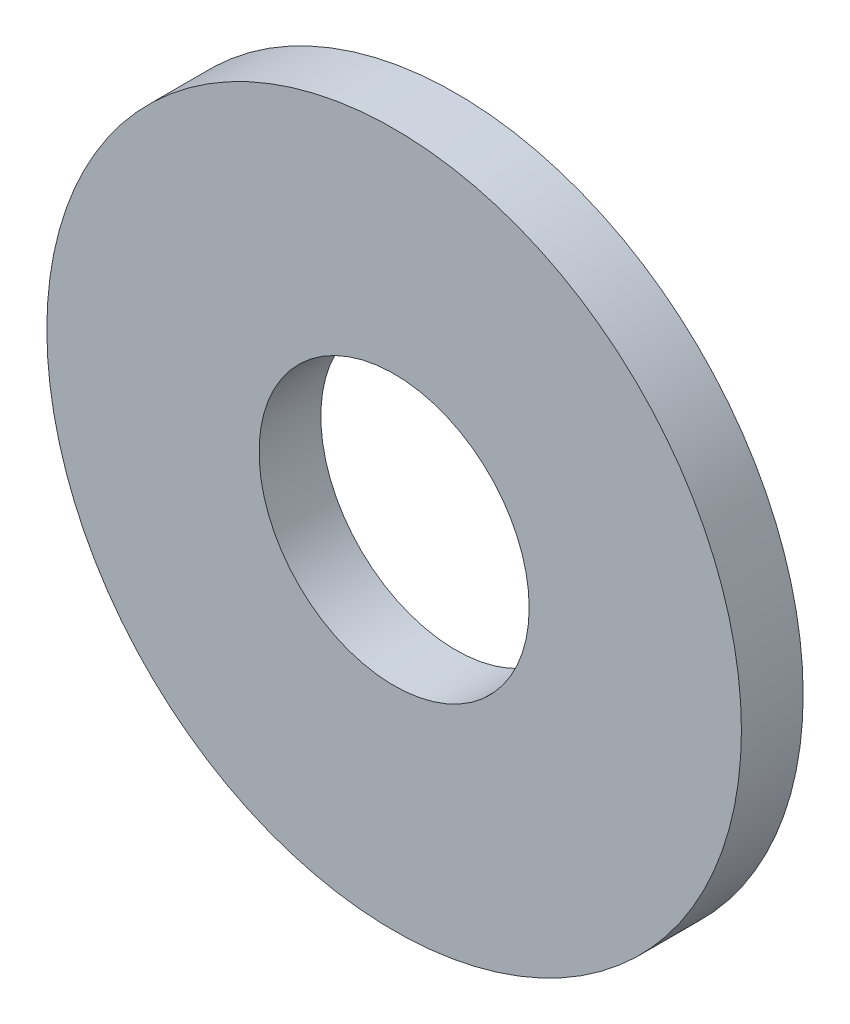
ISO-10303-21;
HEADER;
FILE_DESCRIPTION(('STEP AP214'),'2;1');
FILE_NAME('part.step','',(''),(''),'','','');
FILE_SCHEMA(('AUTOMOTIVE_DESIGN { 1 0 10303 214 1 1 1 1 }'));
ENDSEC;
DATA;
#1=APPLICATION_CONTEXT('core data for automotive mechanical design processes');
#2=APPLICATION_PROTOCOL_DEFINITION('international standard','automotive_design',2000,#1);
#3=PRODUCT_CONTEXT('',#1,'mechanical');
#4=PRODUCT('Part','Part','',(#3));
#5=PRODUCT_RELATED_PRODUCT_CATEGORY('part','',(#4));
#6=PRODUCT_DEFINITION_FORMATION('','',#4);
#7=PRODUCT_DEFINITION_CONTEXT('part definition',#1,'design');
#8=PRODUCT_DEFINITION('design','',#6,#7);
#9=PRODUCT_DEFINITION_SHAPE('','',#8);
#10=(LENGTH_UNIT() NAMED_UNIT(*) SI_UNIT(.MILLI.,.METRE.));
#11=(NAMED_UNIT(*) PLANE_ANGLE_UNIT() SI_UNIT($,.RADIAN.));
#12=(NAMED_UNIT(*) SI_UNIT($,.STERADIAN.) SOLID_ANGLE_UNIT());
#13=UNCERTAINTY_MEASURE_WITH_UNIT(LENGTH_MEASURE(1.E-05),#10,'distance_accuracy_value','');
#14=(GEOMETRIC_REPRESENTATION_CONTEXT(3) GLOBAL_UNCERTAINTY_ASSIGNED_CONTEXT((#13)) GLOBAL_UNIT_ASSIGNED_CONTEXT((#10,
#11,#12)) REPRESENTATION_CONTEXT('',''));
#15=CARTESIAN_POINT('',(0.,0.,0.));
#16=DIRECTION('',(0.,0.,1.));
#17=DIRECTION('',(1.,0.,0.));
#18=AXIS2_PLACEMENT_3D('',#15,#16,#17);
#19=CARTESIAN_POINT('',(0.,0.,1.6));
#20=DIRECTION('',(0.,0.,1.));
#21=DIRECTION('',(1.,0.,0.));
#22=AXIS2_PLACEMENT_3D('',#19,#20,#21);
#23=PLANE('',#22);
#24=CARTESIAN_POINT('',(0.,0.,1.6));
#25=DIRECTION('',(0.,0.,1.));
#26=DIRECTION('',(1.,0.,0.));
#27=AXIS2_PLACEMENT_3D('',#24,#25,#26);
#28=CIRCLE('',#27,9.);
#29=CARTESIAN_POINT('',(9.,0.,1.6));
#30=VERTEX_POINT('',#29);
#31=EDGE_CURVE('E10',#30,#30,#28,.T.);
#32=ORIENTED_EDGE('',*,*,#31,.T.);
#33=EDGE_LOOP('',(#32));
#34=FACE_BOUND('',#33,.T.);
#35=CARTESIAN_POINT('',(0.,0.,1.6));
#36=DIRECTION('',(0.,0.,1.));
#37=DIRECTION('',(1.,0.,0.));
#38=AXIS2_PLACEMENT_3D('',#35,#36,#37);
#39=CIRCLE('',#38,3.5);
#40=CARTESIAN_POINT('',(3.5,0.,1.6));
#41=VERTEX_POINT('',#40);
#42=EDGE_CURVE('E42',#41,#41,#39,.T.);
#43=ORIENTED_EDGE('',*,*,#42,.F.);
#44=EDGE_LOOP('',(#43));
#45=FACE_BOUND('',#44,.T.);
#46=ADVANCED_FACE('F31',(#34,#45),#23,.T.);
#47=CARTESIAN_POINT('',(0.,0.,0.));
#48=DIRECTION('',(0.,0.,1.));
#49=DIRECTION('',(1.,0.,0.));
#50=AXIS2_PLACEMENT_3D('',#47,#48,#49);
#51=PLANE('',#50);
#52=CARTESIAN_POINT('',(0.,0.,0.));
#53=DIRECTION('',(0.,0.,1.));
#54=DIRECTION('',(1.,0.,0.));
#55=AXIS2_PLACEMENT_3D('',#52,#53,#54);
#56=CIRCLE('',#55,9.);
#57=CARTESIAN_POINT('',(9.,0.,0.));
#58=VERTEX_POINT('',#57);
#59=EDGE_CURVE('E35',#58,#58,#56,.T.);
#60=ORIENTED_EDGE('',*,*,#59,.F.);
#61=EDGE_LOOP('',(#60));
#62=FACE_BOUND('',#61,.T.);
#63=CARTESIAN_POINT('',(0.,0.,0.));
#64=DIRECTION('',(0.,0.,1.));
#65=DIRECTION('',(1.,0.,0.));
#66=AXIS2_PLACEMENT_3D('',#63,#64,#65);
#67=CIRCLE('',#66,3.5);
#68=CARTESIAN_POINT('',(3.5,0.,0.));
#69=VERTEX_POINT('',#68);
#70=EDGE_CURVE('E44',#69,#69,#67,.T.);
#71=ORIENTED_EDGE('',*,*,#70,.T.);
#72=EDGE_LOOP('',(#71));
#73=FACE_BOUND('',#72,.T.);
#74=ADVANCED_FACE('F54',(#62,#73),#51,.F.);
#75=CARTESIAN_POINT('',(0.,0.,1.6));
#76=DIRECTION('',(0.,0.,-1.));
#77=DIRECTION('',(-1.,0.,0.));
#78=AXIS2_PLACEMENT_3D('',#75,#76,#77);
#79=CYLINDRICAL_SURFACE('',#78,9.);
#80=ORIENTED_EDGE('',*,*,#31,.F.);
#81=EDGE_LOOP('',(#80));
#82=FACE_BOUND('',#81,.T.);
#83=ORIENTED_EDGE('',*,*,#59,.T.);
#84=EDGE_LOOP('',(#83));
#85=FACE_BOUND('',#84,.T.);
#86=ADVANCED_FACE('F33',(#82,#85),#79,.T.);
#87=CARTESIAN_POINT('',(0.,0.,1.6));
#88=DIRECTION('',(0.,0.,-1.));
#89=DIRECTION('',(-1.,0.,0.));
#90=AXIS2_PLACEMENT_3D('',#87,#88,#89);
#91=CYLINDRICAL_SURFACE('',#90,3.5);
#92=ORIENTED_EDGE('',*,*,#42,.T.);
#93=EDGE_LOOP('',(#92));
#94=FACE_BOUND('',#93,.T.);
#95=ORIENTED_EDGE('',*,*,#70,.F.);
#96=EDGE_LOOP('',(#95));
#97=FACE_BOUND('',#96,.T.);
#98=ADVANCED_FACE('F50',(#94,#97),#91,.F.);
#99=CLOSED_SHELL('',(#46,#74,#86,#98));
#100=MANIFOLD_SOLID_BREP('B2',#99);
#101=ADVANCED_BREP_SHAPE_REPRESENTATION('',(#18,#100),#14);
#102=SHAPE_DEFINITION_REPRESENTATION(#9,#101);
ENDSEC;
END-ISO-10303-21;
